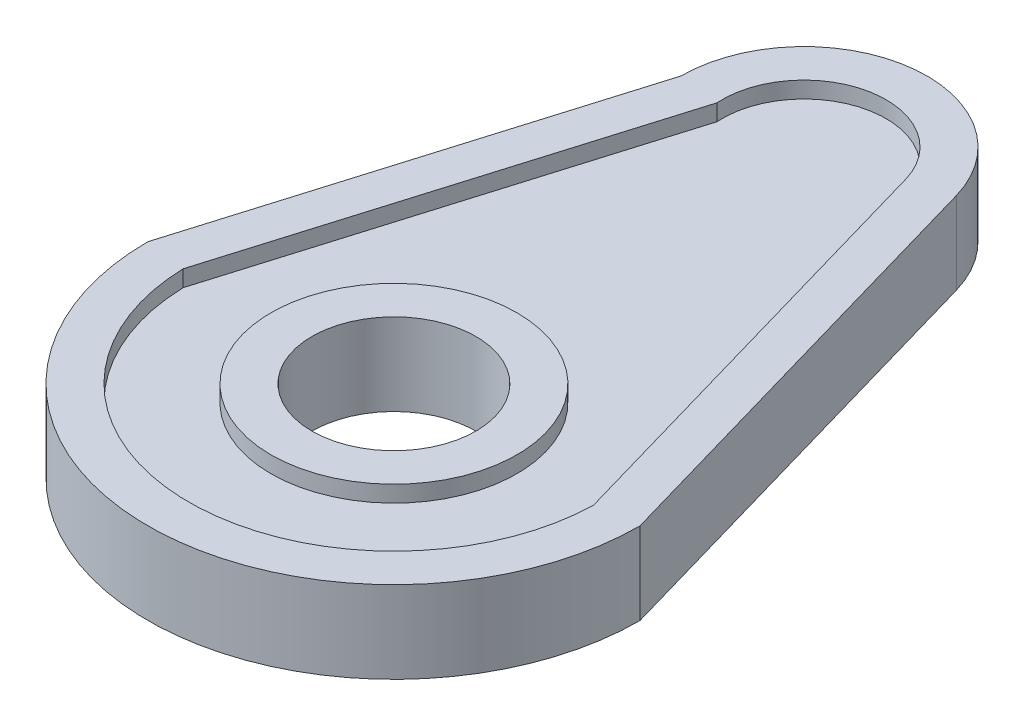
ISO-10303-21;
HEADER;
FILE_DESCRIPTION(('STEP AP214'),'2;1');
FILE_NAME('part.step','',(''),(''),'','','');
FILE_SCHEMA(('AUTOMOTIVE_DESIGN { 1 0 10303 214 1 1 1 1 }'));
ENDSEC;
DATA;
#1=APPLICATION_CONTEXT('core data for automotive mechanical design processes');
#2=APPLICATION_PROTOCOL_DEFINITION('international standard','automotive_design',2000,#1);
#3=PRODUCT_CONTEXT('',#1,'mechanical');
#4=PRODUCT('Part','Part','',(#3));
#5=PRODUCT_RELATED_PRODUCT_CATEGORY('part','',(#4));
#6=PRODUCT_DEFINITION_FORMATION('','',#4);
#7=PRODUCT_DEFINITION_CONTEXT('part definition',#1,'design');
#8=PRODUCT_DEFINITION('design','',#6,#7);
#9=PRODUCT_DEFINITION_SHAPE('','',#8);
#10=(LENGTH_UNIT() NAMED_UNIT(*) SI_UNIT(.MILLI.,.METRE.));
#11=(NAMED_UNIT(*) PLANE_ANGLE_UNIT() SI_UNIT($,.RADIAN.));
#12=(NAMED_UNIT(*) SI_UNIT($,.STERADIAN.) SOLID_ANGLE_UNIT());
#13=UNCERTAINTY_MEASURE_WITH_UNIT(LENGTH_MEASURE(1.E-05),#10,'distance_accuracy_value','');
#14=(GEOMETRIC_REPRESENTATION_CONTEXT(3) GLOBAL_UNCERTAINTY_ASSIGNED_CONTEXT((#13)) GLOBAL_UNIT_ASSIGNED_CONTEXT((#10,
#11,#12)) REPRESENTATION_CONTEXT('',''));
#15=CARTESIAN_POINT('',(0.,0.,0.));
#16=DIRECTION('',(0.,0.,1.));
#17=DIRECTION('',(1.,0.,0.));
#18=AXIS2_PLACEMENT_3D('',#15,#16,#17);
#19=CARTESIAN_POINT('',(0.,3.,0.));
#20=DIRECTION('',(0.,1.,0.));
#21=DIRECTION('',(0.,0.,1.));
#22=AXIS2_PLACEMENT_3D('',#19,#20,#21);
#23=PLANE('',#22);
#24=CARTESIAN_POINT('',(0.,3.,0.));
#25=DIRECTION('',(0.,1.,0.));
#26=DIRECTION('',(0.,0.,1.));
#27=AXIS2_PLACEMENT_3D('',#24,#25,#26);
#28=CIRCLE('',#27,25.);
#29=CARTESIAN_POINT('',(-24.9901680548468,3.,0.701071031006765));
#30=VERTEX_POINT('',#29);
#31=CARTESIAN_POINT('',(24.9909210801856,3.,0.673693969051964));
#32=VERTEX_POINT('',#31);
#33=EDGE_CURVE('E166',#30,#32,#28,.T.);
#34=ORIENTED_EDGE('',*,*,#33,.T.);
#35=DIRECTION('',(-0.276592397187558,0.,-0.96098732864593));
#36=VECTOR('',#35,1.);
#37=CARTESIAN_POINT('',(24.9909210801856,3.,0.673693969051964));
#38=LINE('',#37,#36);
#39=CARTESIAN_POINT('',(9.60987328645931,3.,-52.7659239718756));
#40=VERTEX_POINT('',#39);
#41=EDGE_CURVE('E169',#32,#40,#38,.T.);
#42=ORIENTED_EDGE('',*,*,#41,.T.);
#43=CARTESIAN_POINT('',(0.,3.,-50.));
#44=DIRECTION('',(0.,1.,0.));
#45=DIRECTION('',(0.,0.,1.));
#46=AXIS2_PLACEMENT_3D('',#43,#44,#45);
#47=CIRCLE('',#46,10.);
#48=CARTESIAN_POINT('',(-9.97813305763932,3.,-49.3390456263513));
#49=VERTEX_POINT('',#48);
#50=EDGE_CURVE('E173',#40,#49,#47,.T.);
#51=ORIENTED_EDGE('',*,*,#50,.T.);
#52=DIRECTION('',(-0.287347885566346,0.,0.957826285221151));
#53=VECTOR('',#52,1.);
#54=CARTESIAN_POINT('',(-9.97813305763932,3.,-49.3390456263513));
#55=LINE('',#54,#53);
#56=EDGE_CURVE('E176',#49,#30,#55,.T.);
#57=ORIENTED_EDGE('',*,*,#56,.T.);
#58=EDGE_LOOP('',(#34,#42,#51,#57));
#59=FACE_BOUND('',#58,.T.);
#60=CARTESIAN_POINT('',(0.,3.,0.));
#61=DIRECTION('',(0.,1.,0.));
#62=DIRECTION('',(0.,0.,1.));
#63=AXIS2_PLACEMENT_3D('',#60,#61,#62);
#64=CIRCLE('',#63,15.);
#65=CARTESIAN_POINT('',(0.,3.,15.));
#66=VERTEX_POINT('',#65);
#67=EDGE_CURVE('E150',#66,#66,#64,.T.);
#68=ORIENTED_EDGE('',*,*,#67,.F.);
#69=EDGE_LOOP('',(#68));
#70=FACE_BOUND('',#69,.T.);
#71=ADVANCED_FACE('F35',(#59,#70),#23,.T.);
#72=CARTESIAN_POINT('',(0.,-5.,0.));
#73=DIRECTION('',(0.,1.,0.));
#74=DIRECTION('',(0.,0.,1.));
#75=AXIS2_PLACEMENT_3D('',#72,#73,#74);
#76=PLANE('',#75);
#77=DIRECTION('',(0.276592397187558,0.,0.96098732864593));
#78=VECTOR('',#77,1.);
#79=CARTESIAN_POINT('',(27.7048993745412,-5.,-7.97405366691135));
#80=LINE('',#79,#78);
#81=CARTESIAN_POINT('',(14.414809929689,-5.,-54.1488859578134));
#82=VERTEX_POINT('',#81);
#83=CARTESIAN_POINT('',(30.,-5.,0.));
#84=VERTEX_POINT('',#83);
#85=EDGE_CURVE('E191',#82,#84,#80,.T.);
#86=ORIENTED_EDGE('',*,*,#85,.T.);
#87=CARTESIAN_POINT('',(0.,-5.,0.));
#88=DIRECTION('',(0.,1.,0.));
#89=DIRECTION('',(0.,0.,1.));
#90=AXIS2_PLACEMENT_3D('',#87,#88,#89);
#91=CIRCLE('',#90,30.);
#92=CARTESIAN_POINT('',(-30.,-5.,0.));
#93=VERTEX_POINT('',#92);
#94=EDGE_CURVE('E201',#93,#84,#91,.T.);
#95=ORIENTED_EDGE('',*,*,#94,.F.);
#96=DIRECTION('',(-0.287347885566345,0.,0.957826285221151));
#97=VECTOR('',#96,1.);
#98=CARTESIAN_POINT('',(-27.5229357798165,-5.,-8.25688073394496));
#99=LINE('',#98,#97);
#100=CARTESIAN_POINT('',(-15.,-5.,-50.));
#101=VERTEX_POINT('',#100);
#102=EDGE_CURVE('E212',#101,#93,#99,.T.);
#103=ORIENTED_EDGE('',*,*,#102,.F.);
#104=CARTESIAN_POINT('',(0.,-5.,-50.));
#105=DIRECTION('',(0.,1.,0.));
#106=DIRECTION('',(0.,0.,1.));
#107=AXIS2_PLACEMENT_3D('',#104,#105,#106);
#108=CIRCLE('',#107,15.);
#109=EDGE_CURVE('E210',#82,#101,#108,.T.);
#110=ORIENTED_EDGE('',*,*,#109,.F.);
#111=EDGE_LOOP('',(#86,#95,#103,#110));
#112=FACE_BOUND('',#111,.T.);
#113=CARTESIAN_POINT('',(0.,-5.,0.));
#114=DIRECTION('',(0.,1.,0.));
#115=DIRECTION('',(0.,0.,1.));
#116=AXIS2_PLACEMENT_3D('',#113,#114,#115);
#117=CIRCLE('',#116,25.);
#118=CARTESIAN_POINT('',(-24.9901680548468,-5.,0.701071031006766));
#119=VERTEX_POINT('',#118);
#120=CARTESIAN_POINT('',(24.9909210801856,-5.,0.673693969051964));
#121=VERTEX_POINT('',#120);
#122=EDGE_CURVE('E50',#119,#121,#117,.T.);
#123=ORIENTED_EDGE('',*,*,#122,.T.);
#124=DIRECTION('',(-0.276592397187558,0.,-0.96098732864593));
#125=VECTOR('',#124,1.);
#126=CARTESIAN_POINT('',(24.9909210801856,-5.,0.673693969051964));
#127=LINE('',#126,#125);
#128=CARTESIAN_POINT('',(9.60987328645931,-5.,-52.7659239718756));
#129=VERTEX_POINT('',#128);
#130=EDGE_CURVE('E144',#121,#129,#127,.T.);
#131=ORIENTED_EDGE('',*,*,#130,.T.);
#132=CARTESIAN_POINT('',(0.,-5.,-50.));
#133=DIRECTION('',(0.,1.,0.));
#134=DIRECTION('',(0.,0.,1.));
#135=AXIS2_PLACEMENT_3D('',#132,#133,#134);
#136=CIRCLE('',#135,10.);
#137=CARTESIAN_POINT('',(-9.97813305763932,-5.,-49.3390456263513));
#138=VERTEX_POINT('',#137);
#139=EDGE_CURVE('E147',#129,#138,#136,.T.);
#140=ORIENTED_EDGE('',*,*,#139,.T.);
#141=DIRECTION('',(-0.287347885566346,0.,0.957826285221151));
#142=VECTOR('',#141,1.);
#143=CARTESIAN_POINT('',(-9.97813305763932,-5.,-49.3390456263513));
#144=LINE('',#143,#142);
#145=EDGE_CURVE('E156',#138,#119,#144,.T.);
#146=ORIENTED_EDGE('',*,*,#145,.T.);
#147=EDGE_LOOP('',(#123,#131,#140,#146));
#148=FACE_BOUND('',#147,.T.);
#149=ADVANCED_FACE('F232',(#112,#148),#76,.F.);
#150=CARTESIAN_POINT('',(27.7048993745412,5.,-7.97405366691135));
#151=DIRECTION('',(0.96098732864593,0.,-0.276592397187558));
#152=DIRECTION('',(-0.276592397187558,0.,-0.96098732864593));
#153=AXIS2_PLACEMENT_3D('',#150,#151,#152);
#154=PLANE('',#153);
#155=ORIENTED_EDGE('',*,*,#85,.F.);
#156=DIRECTION('',(0.,-1.,0.));
#157=VECTOR('',#156,1.);
#158=CARTESIAN_POINT('',(14.414809929689,5.,-54.1488859578134));
#159=LINE('',#158,#157);
#160=CARTESIAN_POINT('',(14.414809929689,5.,-54.1488859578134));
#161=VERTEX_POINT('',#160);
#162=EDGE_CURVE('E43',#161,#82,#159,.T.);
#163=ORIENTED_EDGE('',*,*,#162,.F.);
#164=DIRECTION('',(0.276592397187558,0.,0.96098732864593));
#165=VECTOR('',#164,1.);
#166=CARTESIAN_POINT('',(27.7048993745412,5.,-7.97405366691135));
#167=LINE('',#166,#165);
#168=CARTESIAN_POINT('',(30.,5.,0.));
#169=VERTEX_POINT('',#168);
#170=EDGE_CURVE('E197',#161,#169,#167,.T.);
#171=ORIENTED_EDGE('',*,*,#170,.T.);
#172=DIRECTION('',(0.,-1.,0.));
#173=VECTOR('',#172,1.);
#174=CARTESIAN_POINT('',(30.,5.,0.));
#175=LINE('',#174,#173);
#176=EDGE_CURVE('E207',#169,#84,#175,.T.);
#177=ORIENTED_EDGE('',*,*,#176,.T.);
#178=EDGE_LOOP('',(#155,#163,#171,#177));
#179=FACE_BOUND('',#178,.T.);
#180=ADVANCED_FACE('F37',(#179),#154,.T.);
#181=CARTESIAN_POINT('',(0.,5.,-50.));
#182=DIRECTION('',(0.,-1.,0.));
#183=DIRECTION('',(0.,0.,-1.));
#184=AXIS2_PLACEMENT_3D('',#181,#182,#183);
#185=CYLINDRICAL_SURFACE('',#184,15.);
#186=ORIENTED_EDGE('',*,*,#109,.T.);
#187=DIRECTION('',(0.,-1.,0.));
#188=VECTOR('',#187,1.);
#189=CARTESIAN_POINT('',(-15.,5.,-50.));
#190=LINE('',#189,#188);
#191=CARTESIAN_POINT('',(-15.,5.,-50.));
#192=VERTEX_POINT('',#191);
#193=EDGE_CURVE('E220',#192,#101,#190,.T.);
#194=ORIENTED_EDGE('',*,*,#193,.F.);
#195=CARTESIAN_POINT('',(0.,5.,-50.));
#196=DIRECTION('',(0.,1.,0.));
#197=DIRECTION('',(0.,0.,1.));
#198=AXIS2_PLACEMENT_3D('',#195,#196,#197);
#199=CIRCLE('',#198,15.);
#200=EDGE_CURVE('E200',#161,#192,#199,.T.);
#201=ORIENTED_EDGE('',*,*,#200,.F.);
#202=ORIENTED_EDGE('',*,*,#162,.T.);
#203=EDGE_LOOP('',(#186,#194,#201,#202));
#204=FACE_BOUND('',#203,.T.);
#205=ADVANCED_FACE('F225',(#204),#185,.T.);
#206=CARTESIAN_POINT('',(-27.5229357798165,5.,-8.25688073394496));
#207=DIRECTION('',(0.957826285221151,0.,0.287347885566345));
#208=DIRECTION('',(0.287347885566345,0.,-0.957826285221151));
#209=AXIS2_PLACEMENT_3D('',#206,#207,#208);
#210=PLANE('',#209);
#211=ORIENTED_EDGE('',*,*,#102,.T.);
#212=DIRECTION('',(0.,-1.,0.));
#213=VECTOR('',#212,1.);
#214=CARTESIAN_POINT('',(-30.,5.,0.));
#215=LINE('',#214,#213);
#216=CARTESIAN_POINT('',(-30.,5.,0.));
#217=VERTEX_POINT('',#216);
#218=EDGE_CURVE('E217',#217,#93,#215,.T.);
#219=ORIENTED_EDGE('',*,*,#218,.F.);
#220=DIRECTION('',(-0.287347885566345,0.,0.957826285221151));
#221=VECTOR('',#220,1.);
#222=CARTESIAN_POINT('',(-27.5229357798165,5.,-8.25688073394496));
#223=LINE('',#222,#221);
#224=EDGE_CURVE('E203',#192,#217,#223,.T.);
#225=ORIENTED_EDGE('',*,*,#224,.F.);
#226=ORIENTED_EDGE('',*,*,#193,.T.);
#227=EDGE_LOOP('',(#211,#219,#225,#226));
#228=FACE_BOUND('',#227,.T.);
#229=ADVANCED_FACE('F242',(#228),#210,.F.);
#230=CARTESIAN_POINT('',(0.,5.,0.));
#231=DIRECTION('',(0.,-1.,0.));
#232=DIRECTION('',(0.,0.,-1.));
#233=AXIS2_PLACEMENT_3D('',#230,#231,#232);
#234=CYLINDRICAL_SURFACE('',#233,30.);
#235=ORIENTED_EDGE('',*,*,#94,.T.);
#236=ORIENTED_EDGE('',*,*,#176,.F.);
#237=CARTESIAN_POINT('',(0.,5.,0.));
#238=DIRECTION('',(0.,1.,0.));
#239=DIRECTION('',(0.,0.,1.));
#240=AXIS2_PLACEMENT_3D('',#237,#238,#239);
#241=CIRCLE('',#240,30.);
#242=EDGE_CURVE('E205',#217,#169,#241,.T.);
#243=ORIENTED_EDGE('',*,*,#242,.F.);
#244=ORIENTED_EDGE('',*,*,#218,.T.);
#245=EDGE_LOOP('',(#235,#236,#243,#244));
#246=FACE_BOUND('',#245,.T.);
#247=ADVANCED_FACE('F238',(#246),#234,.T.);
#248=CARTESIAN_POINT('',(0.,5.,0.));
#249=DIRECTION('',(0.,1.,0.));
#250=DIRECTION('',(0.,0.,1.));
#251=AXIS2_PLACEMENT_3D('',#248,#249,#250);
#252=PLANE('',#251);
#253=CARTESIAN_POINT('',(0.,5.,0.));
#254=DIRECTION('',(0.,1.,0.));
#255=DIRECTION('',(0.,0.,1.));
#256=AXIS2_PLACEMENT_3D('',#253,#254,#255);
#257=CIRCLE('',#256,25.);
#258=CARTESIAN_POINT('',(-24.9901680548468,5.,0.701071031006765));
#259=VERTEX_POINT('',#258);
#260=CARTESIAN_POINT('',(24.9909210801856,5.,0.673693969051964));
#261=VERTEX_POINT('',#260);
#262=EDGE_CURVE('E58',#259,#261,#257,.T.);
#263=ORIENTED_EDGE('',*,*,#262,.F.);
#264=DIRECTION('',(-0.287347885566346,0.,0.957826285221151));
#265=VECTOR('',#264,1.);
#266=CARTESIAN_POINT('',(-9.97813305763932,5.,-49.3390456263513));
#267=LINE('',#266,#265);
#268=CARTESIAN_POINT('',(-9.97813305763932,5.,-49.3390456263513));
#269=VERTEX_POINT('',#268);
#270=EDGE_CURVE('E170',#269,#259,#267,.T.);
#271=ORIENTED_EDGE('',*,*,#270,.F.);
#272=CARTESIAN_POINT('',(0.,5.,-50.));
#273=DIRECTION('',(0.,1.,0.));
#274=DIRECTION('',(0.,0.,1.));
#275=AXIS2_PLACEMENT_3D('',#272,#273,#274);
#276=CIRCLE('',#275,10.);
#277=CARTESIAN_POINT('',(9.60987328645931,5.,-52.7659239718756));
#278=VERTEX_POINT('',#277);
#279=EDGE_CURVE('E184',#278,#269,#276,.T.);
#280=ORIENTED_EDGE('',*,*,#279,.F.);
#281=DIRECTION('',(-0.276592397187558,0.,-0.96098732864593));
#282=VECTOR('',#281,1.);
#283=CARTESIAN_POINT('',(24.9909210801856,5.,0.673693969051964));
#284=LINE('',#283,#282);
#285=EDGE_CURVE('E181',#261,#278,#284,.T.);
#286=ORIENTED_EDGE('',*,*,#285,.F.);
#287=EDGE_LOOP('',(#263,#271,#280,#286));
#288=FACE_BOUND('',#287,.T.);
#289=ORIENTED_EDGE('',*,*,#170,.F.);
#290=ORIENTED_EDGE('',*,*,#200,.T.);
#291=ORIENTED_EDGE('',*,*,#224,.T.);
#292=ORIENTED_EDGE('',*,*,#242,.T.);
#293=EDGE_LOOP('',(#289,#290,#291,#292));
#294=FACE_BOUND('',#293,.T.);
#295=ADVANCED_FACE('F244',(#288,#294),#252,.T.);
#296=CARTESIAN_POINT('',(0.,3.,0.));
#297=DIRECTION('',(0.,1.,0.));
#298=DIRECTION('',(0.,0.,1.));
#299=AXIS2_PLACEMENT_3D('',#296,#297,#298);
#300=CYLINDRICAL_SURFACE('',#299,25.);
#301=ORIENTED_EDGE('',*,*,#262,.T.);
#302=DIRECTION('',(0.,1.,0.));
#303=VECTOR('',#302,1.);
#304=CARTESIAN_POINT('',(24.9909210801856,3.,0.673693969051964));
#305=LINE('',#304,#303);
#306=EDGE_CURVE('E179',#32,#261,#305,.T.);
#307=ORIENTED_EDGE('',*,*,#306,.F.);
#308=ORIENTED_EDGE('',*,*,#33,.F.);
#309=DIRECTION('',(0.,1.,0.));
#310=VECTOR('',#309,1.);
#311=CARTESIAN_POINT('',(-24.9901680548468,3.,0.701071031006765));
#312=LINE('',#311,#310);
#313=EDGE_CURVE('E189',#30,#259,#312,.T.);
#314=ORIENTED_EDGE('',*,*,#313,.T.);
#315=EDGE_LOOP('',(#301,#307,#308,#314));
#316=FACE_BOUND('',#315,.T.);
#317=ADVANCED_FACE('F246',(#316),#300,.F.);
#318=CARTESIAN_POINT('',(-9.97813305763932,3.,-49.3390456263513));
#319=DIRECTION('',(-0.957826285221151,0.,-0.287347885566346));
#320=DIRECTION('',(-0.287347885566346,0.,0.957826285221151));
#321=AXIS2_PLACEMENT_3D('',#318,#319,#320);
#322=PLANE('',#321);
#323=ORIENTED_EDGE('',*,*,#270,.T.);
#324=ORIENTED_EDGE('',*,*,#313,.F.);
#325=ORIENTED_EDGE('',*,*,#56,.F.);
#326=DIRECTION('',(0.,1.,0.));
#327=VECTOR('',#326,1.);
#328=CARTESIAN_POINT('',(-9.97813305763932,3.,-49.3390456263513));
#329=LINE('',#328,#327);
#330=EDGE_CURVE('E192',#49,#269,#329,.T.);
#331=ORIENTED_EDGE('',*,*,#330,.T.);
#332=EDGE_LOOP('',(#323,#324,#325,#331));
#333=FACE_BOUND('',#332,.T.);
#334=ADVANCED_FACE('F253',(#333),#322,.F.);
#335=CARTESIAN_POINT('',(0.,3.,-50.));
#336=DIRECTION('',(0.,1.,0.));
#337=DIRECTION('',(0.,0.,1.));
#338=AXIS2_PLACEMENT_3D('',#335,#336,#337);
#339=CYLINDRICAL_SURFACE('',#338,10.);
#340=ORIENTED_EDGE('',*,*,#279,.T.);
#341=ORIENTED_EDGE('',*,*,#330,.F.);
#342=ORIENTED_EDGE('',*,*,#50,.F.);
#343=DIRECTION('',(0.,1.,0.));
#344=VECTOR('',#343,1.);
#345=CARTESIAN_POINT('',(9.60987328645931,3.,-52.7659239718756));
#346=LINE('',#345,#344);
#347=EDGE_CURVE('E194',#40,#278,#346,.T.);
#348=ORIENTED_EDGE('',*,*,#347,.T.);
#349=EDGE_LOOP('',(#340,#341,#342,#348));
#350=FACE_BOUND('',#349,.T.);
#351=ADVANCED_FACE('F269',(#350),#339,.F.);
#352=CARTESIAN_POINT('',(24.9909210801856,3.,0.673693969051964));
#353=DIRECTION('',(0.96098732864593,0.,-0.276592397187558));
#354=DIRECTION('',(-0.276592397187558,0.,-0.96098732864593));
#355=AXIS2_PLACEMENT_3D('',#352,#353,#354);
#356=PLANE('',#355);
#357=ORIENTED_EDGE('',*,*,#285,.T.);
#358=ORIENTED_EDGE('',*,*,#347,.F.);
#359=ORIENTED_EDGE('',*,*,#41,.F.);
#360=ORIENTED_EDGE('',*,*,#306,.T.);
#361=EDGE_LOOP('',(#357,#358,#359,#360));
#362=FACE_BOUND('',#361,.T.);
#363=ADVANCED_FACE('F273',(#362),#356,.F.);
#364=CARTESIAN_POINT('',(0.,-3.,0.));
#365=DIRECTION('',(0.,-1.,0.));
#366=DIRECTION('',(0.,0.,-1.));
#367=AXIS2_PLACEMENT_3D('',#364,#365,#366);
#368=CYLINDRICAL_SURFACE('',#367,25.);
#369=ORIENTED_EDGE('',*,*,#122,.F.);
#370=DIRECTION('',(0.,-1.,0.));
#371=VECTOR('',#370,1.);
#372=CARTESIAN_POINT('',(-24.9901680548468,-3.,0.701071031006765));
#373=LINE('',#372,#371);
#374=CARTESIAN_POINT('',(-24.9901680548468,-3.,0.701071031006765));
#375=VERTEX_POINT('',#374);
#376=EDGE_CURVE('E129',#375,#119,#373,.T.);
#377=ORIENTED_EDGE('',*,*,#376,.F.);
#378=CARTESIAN_POINT('',(0.,-3.,0.));
#379=DIRECTION('',(0.,1.,0.));
#380=DIRECTION('',(0.,0.,1.));
#381=AXIS2_PLACEMENT_3D('',#378,#379,#380);
#382=CIRCLE('',#381,25.);
#383=CARTESIAN_POINT('',(24.9909210801856,-3.,0.673693969051964));
#384=VERTEX_POINT('',#383);
#385=EDGE_CURVE('E136',#375,#384,#382,.T.);
#386=ORIENTED_EDGE('',*,*,#385,.T.);
#387=DIRECTION('',(0.,-1.,0.));
#388=VECTOR('',#387,1.);
#389=CARTESIAN_POINT('',(24.9909210801856,-3.,0.673693969051964));
#390=LINE('',#389,#388);
#391=EDGE_CURVE('E161',#384,#121,#390,.T.);
#392=ORIENTED_EDGE('',*,*,#391,.T.);
#393=EDGE_LOOP('',(#369,#377,#386,#392));
#394=FACE_BOUND('',#393,.T.);
#395=ADVANCED_FACE('F139',(#394),#368,.F.);
#396=CARTESIAN_POINT('',(24.9909210801856,-3.,0.673693969051964));
#397=DIRECTION('',(-0.96098732864593,0.,0.276592397187558));
#398=DIRECTION('',(0.276592397187558,0.,0.96098732864593));
#399=AXIS2_PLACEMENT_3D('',#396,#397,#398);
#400=PLANE('',#399);
#401=ORIENTED_EDGE('',*,*,#130,.F.);
#402=ORIENTED_EDGE('',*,*,#391,.F.);
#403=DIRECTION('',(-0.276592397187558,0.,-0.96098732864593));
#404=VECTOR('',#403,1.);
#405=CARTESIAN_POINT('',(24.9909210801856,-3.,0.673693969051964));
#406=LINE('',#405,#404);
#407=CARTESIAN_POINT('',(9.60987328645931,-3.,-52.7659239718756));
#408=VERTEX_POINT('',#407);
#409=EDGE_CURVE('E141',#384,#408,#406,.T.);
#410=ORIENTED_EDGE('',*,*,#409,.T.);
#411=DIRECTION('',(0.,-1.,0.));
#412=VECTOR('',#411,1.);
#413=CARTESIAN_POINT('',(9.60987328645931,-3.,-52.7659239718756));
#414=LINE('',#413,#412);
#415=EDGE_CURVE('E163',#408,#129,#414,.T.);
#416=ORIENTED_EDGE('',*,*,#415,.T.);
#417=EDGE_LOOP('',(#401,#402,#410,#416));
#418=FACE_BOUND('',#417,.T.);
#419=ADVANCED_FACE('F280',(#418),#400,.T.);
#420=CARTESIAN_POINT('',(0.,-3.,-50.));
#421=DIRECTION('',(0.,-1.,0.));
#422=DIRECTION('',(0.,0.,-1.));
#423=AXIS2_PLACEMENT_3D('',#420,#421,#422);
#424=CYLINDRICAL_SURFACE('',#423,10.);
#425=ORIENTED_EDGE('',*,*,#139,.F.);
#426=ORIENTED_EDGE('',*,*,#415,.F.);
#427=CARTESIAN_POINT('',(0.,-3.,-50.));
#428=DIRECTION('',(0.,1.,0.));
#429=DIRECTION('',(0.,0.,1.));
#430=AXIS2_PLACEMENT_3D('',#427,#428,#429);
#431=CIRCLE('',#430,10.);
#432=CARTESIAN_POINT('',(-9.97813305763932,-3.,-49.3390456263513));
#433=VERTEX_POINT('',#432);
#434=EDGE_CURVE('E135',#408,#433,#431,.T.);
#435=ORIENTED_EDGE('',*,*,#434,.T.);
#436=DIRECTION('',(0.,-1.,0.));
#437=VECTOR('',#436,1.);
#438=CARTESIAN_POINT('',(-9.97813305763932,-3.,-49.3390456263513));
#439=LINE('',#438,#437);
#440=EDGE_CURVE('E131',#433,#138,#439,.T.);
#441=ORIENTED_EDGE('',*,*,#440,.T.);
#442=EDGE_LOOP('',(#425,#426,#435,#441));
#443=FACE_BOUND('',#442,.T.);
#444=ADVANCED_FACE('F291',(#443),#424,.F.);
#445=CARTESIAN_POINT('',(-9.97813305763932,-3.,-49.3390456263513));
#446=DIRECTION('',(0.957826285221151,0.,0.287347885566346));
#447=DIRECTION('',(0.287347885566346,0.,-0.957826285221151));
#448=AXIS2_PLACEMENT_3D('',#445,#446,#447);
#449=PLANE('',#448);
#450=ORIENTED_EDGE('',*,*,#145,.F.);
#451=ORIENTED_EDGE('',*,*,#440,.F.);
#452=DIRECTION('',(-0.287347885566346,0.,0.957826285221151));
#453=VECTOR('',#452,1.);
#454=CARTESIAN_POINT('',(-9.97813305763932,-3.,-49.3390456263513));
#455=LINE('',#454,#453);
#456=EDGE_CURVE('E126',#433,#375,#455,.T.);
#457=ORIENTED_EDGE('',*,*,#456,.T.);
#458=ORIENTED_EDGE('',*,*,#376,.T.);
#459=EDGE_LOOP('',(#450,#451,#457,#458));
#460=FACE_BOUND('',#459,.T.);
#461=ADVANCED_FACE('F128',(#460),#449,.T.);
#462=CARTESIAN_POINT('',(0.,-3.,0.));
#463=DIRECTION('',(0.,-1.,0.));
#464=DIRECTION('',(0.,0.,1.));
#465=AXIS2_PLACEMENT_3D('',#462,#463,#464);
#466=PLANE('',#465);
#467=CARTESIAN_POINT('',(0.,-3.,0.));
#468=DIRECTION('',(0.,-1.,0.));
#469=DIRECTION('',(0.,0.,-1.));
#470=AXIS2_PLACEMENT_3D('',#467,#468,#469);
#471=CIRCLE('',#470,15.);
#472=CARTESIAN_POINT('',(0.,-3.,-15.));
#473=VERTEX_POINT('',#472);
#474=EDGE_CURVE('E11',#473,#473,#471,.T.);
#475=ORIENTED_EDGE('',*,*,#474,.F.);
#476=EDGE_LOOP('',(#475));
#477=FACE_BOUND('',#476,.T.);
#478=ORIENTED_EDGE('',*,*,#385,.F.);
#479=ORIENTED_EDGE('',*,*,#456,.F.);
#480=ORIENTED_EDGE('',*,*,#434,.F.);
#481=ORIENTED_EDGE('',*,*,#409,.F.);
#482=EDGE_LOOP('',(#478,#479,#480,#481));
#483=FACE_BOUND('',#482,.T.);
#484=ADVANCED_FACE('F143',(#477,#483),#466,.T.);
#485=CARTESIAN_POINT('',(0.,-5.,0.));
#486=DIRECTION('',(0.,1.,0.));
#487=DIRECTION('',(0.,0.,1.));
#488=AXIS2_PLACEMENT_3D('',#485,#486,#487);
#489=CYLINDRICAL_SURFACE('',#488,10.);
#490=CARTESIAN_POINT('',(0.,5.,0.));
#491=DIRECTION('',(0.,1.,0.));
#492=DIRECTION('',(0.,0.,1.));
#493=AXIS2_PLACEMENT_3D('',#490,#491,#492);
#494=CIRCLE('',#493,10.);
#495=CARTESIAN_POINT('',(0.,5.,10.));
#496=VERTEX_POINT('',#495);
#497=EDGE_CURVE('E339',#496,#496,#494,.T.);
#498=ORIENTED_EDGE('',*,*,#497,.T.);
#499=EDGE_LOOP('',(#498));
#500=FACE_BOUND('',#499,.T.);
#501=CARTESIAN_POINT('',(0.,-5.,0.));
#502=DIRECTION('',(0.,1.,0.));
#503=DIRECTION('',(0.,0.,1.));
#504=AXIS2_PLACEMENT_3D('',#501,#502,#503);
#505=CIRCLE('',#504,10.);
#506=CARTESIAN_POINT('',(0.,-5.,10.));
#507=VERTEX_POINT('',#506);
#508=EDGE_CURVE('E343',#507,#507,#505,.T.);
#509=ORIENTED_EDGE('',*,*,#508,.F.);
#510=EDGE_LOOP('',(#509));
#511=FACE_BOUND('',#510,.T.);
#512=ADVANCED_FACE('F305',(#500,#511),#489,.F.);
#513=CARTESIAN_POINT('',(0.,5.,0.));
#514=DIRECTION('',(0.,1.,0.));
#515=DIRECTION('',(0.,0.,1.));
#516=AXIS2_PLACEMENT_3D('',#513,#514,#515);
#517=PLANE('',#516);
#518=CARTESIAN_POINT('',(0.,5.,0.));
#519=DIRECTION('',(0.,1.,0.));
#520=DIRECTION('',(0.,0.,1.));
#521=AXIS2_PLACEMENT_3D('',#518,#519,#520);
#522=CIRCLE('',#521,15.);
#523=CARTESIAN_POINT('',(0.,5.,15.));
#524=VERTEX_POINT('',#523);
#525=EDGE_CURVE('E157',#524,#524,#522,.T.);
#526=ORIENTED_EDGE('',*,*,#525,.T.);
#527=EDGE_LOOP('',(#526));
#528=FACE_BOUND('',#527,.T.);
#529=ORIENTED_EDGE('',*,*,#497,.F.);
#530=EDGE_LOOP('',(#529));
#531=FACE_BOUND('',#530,.T.);
#532=ADVANCED_FACE('F310',(#528,#531),#517,.T.);
#533=CARTESIAN_POINT('',(0.,5.,0.));
#534=DIRECTION('',(0.,-1.,0.));
#535=DIRECTION('',(0.,0.,-1.));
#536=AXIS2_PLACEMENT_3D('',#533,#534,#535);
#537=CYLINDRICAL_SURFACE('',#536,15.);
#538=ORIENTED_EDGE('',*,*,#525,.F.);
#539=EDGE_LOOP('',(#538));
#540=FACE_BOUND('',#539,.T.);
#541=ORIENTED_EDGE('',*,*,#67,.T.);
#542=EDGE_LOOP('',(#541));
#543=FACE_BOUND('',#542,.T.);
#544=ADVANCED_FACE('F317',(#540,#543),#537,.T.);
#545=CARTESIAN_POINT('',(0.,-5.,0.));
#546=DIRECTION('',(0.,1.,0.));
#547=DIRECTION('',(0.,0.,1.));
#548=AXIS2_PLACEMENT_3D('',#545,#546,#547);
#549=CYLINDRICAL_SURFACE('',#548,15.);
#550=CARTESIAN_POINT('',(0.,-5.,0.));
#551=DIRECTION('',(0.,1.,0.));
#552=DIRECTION('',(0.,0.,1.));
#553=AXIS2_PLACEMENT_3D('',#550,#551,#552);
#554=CIRCLE('',#553,15.);
#555=CARTESIAN_POINT('',(0.,-5.,15.));
#556=VERTEX_POINT('',#555);
#557=EDGE_CURVE('E340',#556,#556,#554,.T.);
#558=ORIENTED_EDGE('',*,*,#557,.T.);
#559=EDGE_LOOP('',(#558));
#560=FACE_BOUND('',#559,.T.);
#561=ORIENTED_EDGE('',*,*,#474,.T.);
#562=EDGE_LOOP('',(#561));
#563=FACE_BOUND('',#562,.T.);
#564=ADVANCED_FACE('F314',(#560,#563),#549,.T.);
#565=CARTESIAN_POINT('',(0.,-5.,0.));
#566=DIRECTION('',(0.,-1.,0.));
#567=DIRECTION('',(0.,0.,1.));
#568=AXIS2_PLACEMENT_3D('',#565,#566,#567);
#569=PLANE('',#568);
#570=ORIENTED_EDGE('',*,*,#508,.T.);
#571=EDGE_LOOP('',(#570));
#572=FACE_BOUND('',#571,.T.);
#573=ORIENTED_EDGE('',*,*,#557,.F.);
#574=EDGE_LOOP('',(#573));
#575=FACE_BOUND('',#574,.T.);
#576=ADVANCED_FACE('F316',(#572,#575),#569,.T.);
#577=CLOSED_SHELL('',(#71,#149,#180,#205,#229,#247,#295,#317,#334,#351,#363,#395,#419,#444,#461,
#484,#512,#532,#544,#564,#576));
#578=MANIFOLD_SOLID_BREP('B2',#577);
#579=ADVANCED_BREP_SHAPE_REPRESENTATION('',(#18,#578),#14);
#580=SHAPE_DEFINITION_REPRESENTATION(#9,#579);
ENDSEC;
END-ISO-10303-21;
